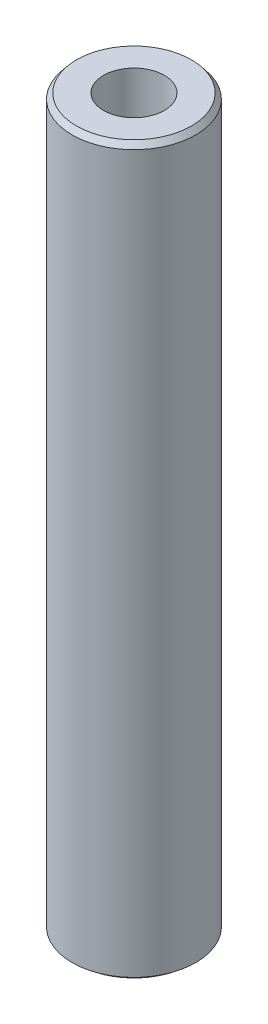
ISO-10303-21;
HEADER;
FILE_DESCRIPTION(('STEP AP214'),'2;1');
FILE_NAME('part.step','',(''),(''),'','','');
FILE_SCHEMA(('AUTOMOTIVE_DESIGN { 1 0 10303 214 1 1 1 1 }'));
ENDSEC;
DATA;
#1=APPLICATION_CONTEXT('core data for automotive mechanical design processes');
#2=APPLICATION_PROTOCOL_DEFINITION('international standard','automotive_design',2000,#1);
#3=PRODUCT_CONTEXT('',#1,'mechanical');
#4=PRODUCT('Part','Part','',(#3));
#5=PRODUCT_RELATED_PRODUCT_CATEGORY('part','',(#4));
#6=PRODUCT_DEFINITION_FORMATION('','',#4);
#7=PRODUCT_DEFINITION_CONTEXT('part definition',#1,'design');
#8=PRODUCT_DEFINITION('design','',#6,#7);
#9=PRODUCT_DEFINITION_SHAPE('','',#8);
#10=(LENGTH_UNIT() NAMED_UNIT(*) SI_UNIT(.MILLI.,.METRE.));
#11=(NAMED_UNIT(*) PLANE_ANGLE_UNIT() SI_UNIT($,.RADIAN.));
#12=(NAMED_UNIT(*) SI_UNIT($,.STERADIAN.) SOLID_ANGLE_UNIT());
#13=UNCERTAINTY_MEASURE_WITH_UNIT(LENGTH_MEASURE(1.E-05),#10,'distance_accuracy_value','');
#14=(GEOMETRIC_REPRESENTATION_CONTEXT(3) GLOBAL_UNCERTAINTY_ASSIGNED_CONTEXT((#13)) GLOBAL_UNIT_ASSIGNED_CONTEXT((#10,
#11,#12)) REPRESENTATION_CONTEXT('',''));
#15=CARTESIAN_POINT('',(0.,0.,0.));
#16=DIRECTION('',(0.,0.,1.));
#17=DIRECTION('',(1.,0.,0.));
#18=AXIS2_PLACEMENT_3D('',#15,#16,#17);
#19=CARTESIAN_POINT('',(0.,176.241932532413,0.));
#20=DIRECTION('',(0.,-1.,0.));
#21=DIRECTION('',(0.,0.,-1.));
#22=AXIS2_PLACEMENT_3D('',#19,#20,#21);
#23=CYLINDRICAL_SURFACE('',#22,15.);
#24=CARTESIAN_POINT('',(0.,174.911636682996,0.));
#25=DIRECTION('',(0.,1.,0.));
#26=DIRECTION('',(0.,0.,1.));
#27=AXIS2_PLACEMENT_3D('',#24,#25,#26);
#28=CIRCLE('',#27,15.);
#29=CARTESIAN_POINT('',(0.,174.911636682996,15.));
#30=VERTEX_POINT('',#29);
#31=EDGE_CURVE('E50',#30,#30,#28,.F.);
#32=ORIENTED_EDGE('',*,*,#31,.T.);
#33=EDGE_LOOP('',(#32));
#34=FACE_BOUND('',#33,.T.);
#35=CARTESIAN_POINT('',(0.,1.07190014682754,0.));
#36=DIRECTION('',(0.,1.,0.));
#37=DIRECTION('',(0.,0.,1.));
#38=AXIS2_PLACEMENT_3D('',#35,#36,#37);
#39=CIRCLE('',#38,15.);
#40=CARTESIAN_POINT('',(0.,1.07190014682754,15.));
#41=VERTEX_POINT('',#40);
#42=EDGE_CURVE('E51',#41,#41,#39,.T.);
#43=ORIENTED_EDGE('',*,*,#42,.T.);
#44=EDGE_LOOP('',(#43));
#45=FACE_BOUND('',#44,.T.);
#46=ADVANCED_FACE('F39',(#34,#45),#23,.T.);
#47=CARTESIAN_POINT('',(0.,176.241932532413,0.));
#48=DIRECTION('',(0.,1.,0.));
#49=DIRECTION('',(0.,0.,1.));
#50=AXIS2_PLACEMENT_3D('',#47,#48,#49);
#51=PLANE('',#50);
#52=CARTESIAN_POINT('',(0.,176.241932532413,0.));
#53=DIRECTION('',(0.,1.,0.));
#54=DIRECTION('',(0.,0.,1.));
#55=AXIS2_PLACEMENT_3D('',#52,#53,#54);
#56=CIRCLE('',#55,13.9280998531725);
#57=CARTESIAN_POINT('',(0.,176.241932532413,13.9280998531725));
#58=VERTEX_POINT('',#57);
#59=EDGE_CURVE('E54',#58,#58,#56,.T.);
#60=ORIENTED_EDGE('',*,*,#59,.T.);
#61=EDGE_LOOP('',(#60));
#62=FACE_BOUND('',#61,.T.);
#63=CARTESIAN_POINT('',(0.,176.241932532413,0.));
#64=DIRECTION('',(0.,1.,0.));
#65=DIRECTION('',(0.,0.,1.));
#66=AXIS2_PLACEMENT_3D('',#63,#64,#65);
#67=CIRCLE('',#66,7.38306966573692);
#68=CARTESIAN_POINT('',(0.,176.241932532413,7.38306966573692));
#69=VERTEX_POINT('',#68);
#70=EDGE_CURVE('E58',#69,#69,#67,.T.);
#71=ORIENTED_EDGE('',*,*,#70,.F.);
#72=EDGE_LOOP('',(#71));
#73=FACE_BOUND('',#72,.T.);
#74=ADVANCED_FACE('F69',(#62,#73),#51,.T.);
#75=CARTESIAN_POINT('',(0.,0.,0.));
#76=DIRECTION('',(0.,1.,0.));
#77=DIRECTION('',(0.,0.,1.));
#78=AXIS2_PLACEMENT_3D('',#75,#76,#77);
#79=PLANE('',#78);
#80=CARTESIAN_POINT('',(0.,0.,0.));
#81=DIRECTION('',(0.,1.,0.));
#82=DIRECTION('',(0.,0.,1.));
#83=AXIS2_PLACEMENT_3D('',#80,#81,#82);
#84=CIRCLE('',#83,13.6697041505835);
#85=CARTESIAN_POINT('',(0.,0.,13.6697041505835));
#86=VERTEX_POINT('',#85);
#87=EDGE_CURVE('E10',#86,#86,#84,.F.);
#88=ORIENTED_EDGE('',*,*,#87,.T.);
#89=EDGE_LOOP('',(#88));
#90=FACE_BOUND('',#89,.T.);
#91=CARTESIAN_POINT('',(0.,0.,0.));
#92=DIRECTION('',(0.,1.,0.));
#93=DIRECTION('',(0.,0.,1.));
#94=AXIS2_PLACEMENT_3D('',#91,#92,#93);
#95=CIRCLE('',#94,7.38306966573692);
#96=CARTESIAN_POINT('',(0.,0.,7.38306966573692));
#97=VERTEX_POINT('',#96);
#98=EDGE_CURVE('E63',#97,#97,#95,.T.);
#99=ORIENTED_EDGE('',*,*,#98,.T.);
#100=EDGE_LOOP('',(#99));
#101=FACE_BOUND('',#100,.T.);
#102=ADVANCED_FACE('F75',(#90,#101),#79,.F.);
#103=CARTESIAN_POINT('',(0.,176.241932532413,0.));
#104=DIRECTION('',(0.,-1.,0.));
#105=DIRECTION('',(0.,0.,-1.));
#106=AXIS2_PLACEMENT_3D('',#103,#104,#105);
#107=CYLINDRICAL_SURFACE('',#106,7.38306966573692);
#108=ORIENTED_EDGE('',*,*,#70,.T.);
#109=EDGE_LOOP('',(#108));
#110=FACE_BOUND('',#109,.T.);
#111=ORIENTED_EDGE('',*,*,#98,.F.);
#112=EDGE_LOOP('',(#111));
#113=FACE_BOUND('',#112,.T.);
#114=ADVANCED_FACE('F70',(#110,#113),#107,.F.);
#115=CARTESIAN_POINT('',(0.,176.241932532413,0.));
#116=DIRECTION('',(0.,-1.,0.));
#117=DIRECTION('',(0.,0.,-1.));
#118=AXIS2_PLACEMENT_3D('',#115,#116,#117);
#119=CONICAL_SURFACE('',#118,13.9280998531725,0.678243721281788);
#120=ORIENTED_EDGE('',*,*,#31,.F.);
#121=EDGE_LOOP('',(#120));
#122=FACE_BOUND('',#121,.T.);
#123=ORIENTED_EDGE('',*,*,#59,.F.);
#124=EDGE_LOOP('',(#123));
#125=FACE_BOUND('',#124,.T.);
#126=ADVANCED_FACE('F81',(#122,#125),#119,.T.);
#127=CARTESIAN_POINT('',(0.,1.07190014682754,0.));
#128=DIRECTION('',(0.,1.,0.));
#129=DIRECTION('',(0.,0.,1.));
#130=AXIS2_PLACEMENT_3D('',#127,#128,#129);
#131=CONICAL_SURFACE('',#130,15.,0.892552605513097);
#132=ORIENTED_EDGE('',*,*,#87,.F.);
#133=EDGE_LOOP('',(#132));
#134=FACE_BOUND('',#133,.T.);
#135=ORIENTED_EDGE('',*,*,#42,.F.);
#136=EDGE_LOOP('',(#135));
#137=FACE_BOUND('',#136,.T.);
#138=ADVANCED_FACE('F45',(#134,#137),#131,.T.);
#139=CLOSED_SHELL('',(#46,#74,#102,#114,#126,#138));
#140=MANIFOLD_SOLID_BREP('B2',#139);
#141=ADVANCED_BREP_SHAPE_REPRESENTATION('',(#18,#140),#14);
#142=SHAPE_DEFINITION_REPRESENTATION(#9,#141);
ENDSEC;
END-ISO-10303-21;
